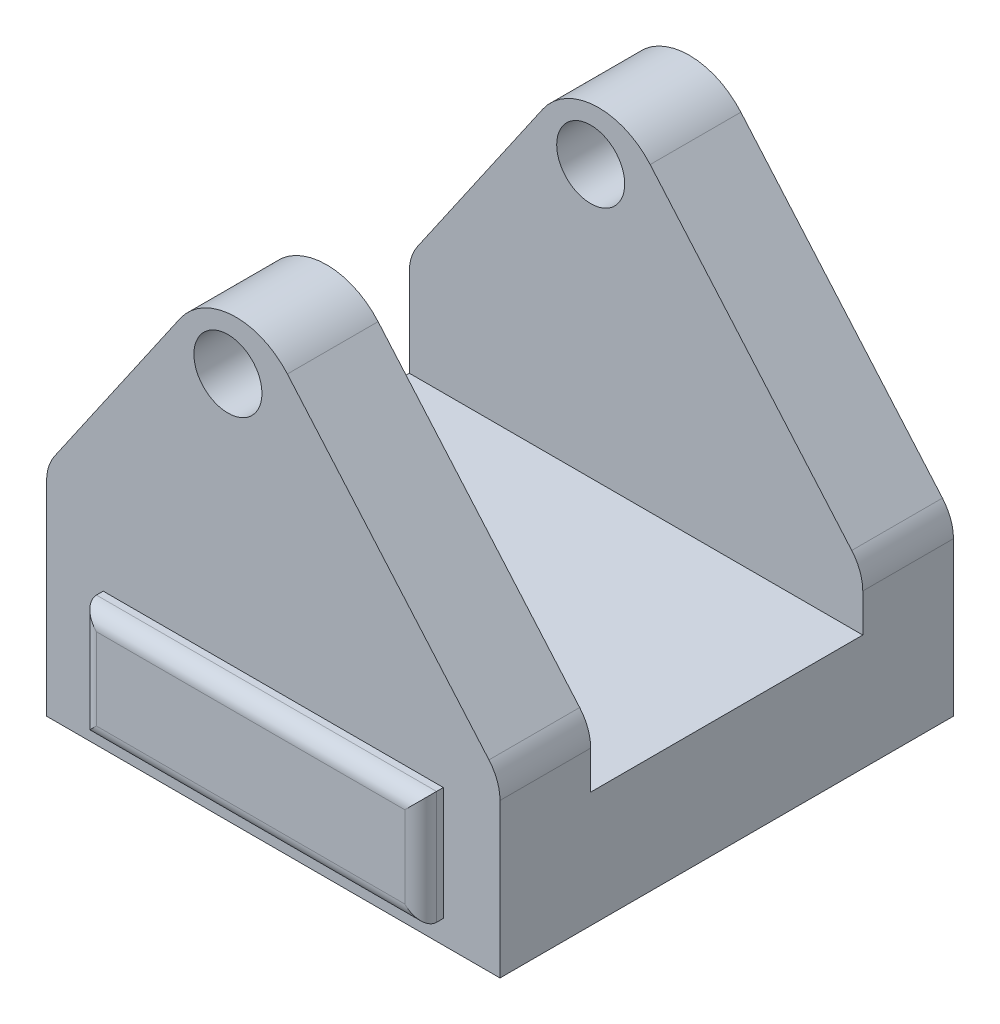
ISO-10303-21;
HEADER;
FILE_DESCRIPTION(('STEP AP214'),'2;1');
FILE_NAME('part.step','',(''),(''),'','','');
FILE_SCHEMA(('AUTOMOTIVE_DESIGN { 1 0 10303 214 1 1 1 1 }'));
ENDSEC;
DATA;
#1=APPLICATION_CONTEXT('core data for automotive mechanical design processes');
#2=APPLICATION_PROTOCOL_DEFINITION('international standard','automotive_design',2000,#1);
#3=PRODUCT_CONTEXT('',#1,'mechanical');
#4=PRODUCT('Part','Part','',(#3));
#5=PRODUCT_RELATED_PRODUCT_CATEGORY('part','',(#4));
#6=PRODUCT_DEFINITION_FORMATION('','',#4);
#7=PRODUCT_DEFINITION_CONTEXT('part definition',#1,'design');
#8=PRODUCT_DEFINITION('design','',#6,#7);
#9=PRODUCT_DEFINITION_SHAPE('','',#8);
#10=(LENGTH_UNIT() NAMED_UNIT(*) SI_UNIT(.MILLI.,.METRE.));
#11=(NAMED_UNIT(*) PLANE_ANGLE_UNIT() SI_UNIT($,.RADIAN.));
#12=(NAMED_UNIT(*) SI_UNIT($,.STERADIAN.) SOLID_ANGLE_UNIT());
#13=UNCERTAINTY_MEASURE_WITH_UNIT(LENGTH_MEASURE(1.E-05),#10,'distance_accuracy_value','');
#14=(GEOMETRIC_REPRESENTATION_CONTEXT(3) GLOBAL_UNCERTAINTY_ASSIGNED_CONTEXT((#13)) GLOBAL_UNIT_ASSIGNED_CONTEXT((#10,
#11,#12)) REPRESENTATION_CONTEXT('',''));
#15=CARTESIAN_POINT('',(0.,0.,0.));
#16=DIRECTION('',(0.,0.,1.));
#17=DIRECTION('',(1.,0.,0.));
#18=AXIS2_PLACEMENT_3D('',#15,#16,#17);
#19=CARTESIAN_POINT('',(-100.,300.,-100.));
#20=DIRECTION('',(0.,0.,1.));
#21=DIRECTION('',(1.,0.,0.));
#22=AXIS2_PLACEMENT_3D('',#19,#20,#21);
#23=PLANE('',#22);
#24=DIRECTION('',(0.65364245259833,-0.756803504326744,0.));
#25=VECTOR('',#24,1.);
#26=CARTESIAN_POINT('',(-19.1359934013816,213.188644877479,-100.));
#27=LINE('',#26,#25);
#28=CARTESIAN_POINT('',(6.22659965479949,183.823203224432,-100.));
#29=VERTEX_POINT('',#28);
#30=CARTESIAN_POINT('',(95.1360700865349,80.8816049192792,-100.));
#31=VERTEX_POINT('',#30);
#32=EDGE_CURVE('E369',#29,#31,#27,.T.);
#33=ORIENTED_EDGE('',*,*,#32,.T.);
#34=CARTESIAN_POINT('',(80.,67.8087558673126,-100.));
#35=DIRECTION('',(0.,0.,1.));
#36=DIRECTION('',(1.,0.,0.));
#37=AXIS2_PLACEMENT_3D('',#34,#35,#36);
#38=CIRCLE('',#37,20.);
#39=CARTESIAN_POINT('',(100.,67.8087558673126,-100.));
#40=VERTEX_POINT('',#39);
#41=EDGE_CURVE('E451',#31,#40,#38,.F.);
#42=ORIENTED_EDGE('',*,*,#41,.T.);
#43=DIRECTION('',(0.,-1.,0.));
#44=VECTOR('',#43,1.);
#45=CARTESIAN_POINT('',(100.,300.,-100.));
#46=LINE('',#45,#44);
#47=CARTESIAN_POINT('',(100.,0.,-100.));
#48=VERTEX_POINT('',#47);
#49=EDGE_CURVE('E412',#40,#48,#46,.T.);
#50=ORIENTED_EDGE('',*,*,#49,.T.);
#51=DIRECTION('',(-1.,0.,0.));
#52=VECTOR('',#51,1.);
#53=CARTESIAN_POINT('',(-100.,0.,-100.));
#54=LINE('',#53,#52);
#55=CARTESIAN_POINT('',(-100.,0.,-100.));
#56=VERTEX_POINT('',#55);
#57=EDGE_CURVE('E391',#48,#56,#54,.T.);
#58=ORIENTED_EDGE('',*,*,#57,.T.);
#59=DIRECTION('',(0.,-1.,0.));
#60=VECTOR('',#59,1.);
#61=CARTESIAN_POINT('',(-100.,300.,-100.));
#62=LINE('',#61,#60);
#63=CARTESIAN_POINT('',(-100.,89.7508937768441,-100.));
#64=VERTEX_POINT('',#63);
#65=EDGE_CURVE('E409',#64,#56,#62,.T.);
#66=ORIENTED_EDGE('',*,*,#65,.F.);
#67=CARTESIAN_POINT('',(-80.,89.7508937768441,-100.));
#68=DIRECTION('',(0.,0.,1.));
#69=DIRECTION('',(1.,0.,0.));
#70=AXIS2_PLACEMENT_3D('',#67,#68,#69);
#71=CIRCLE('',#70,20.);
#72=CARTESIAN_POINT('',(-96.4622250535299,101.108496793631,-100.));
#73=VERTEX_POINT('',#72);
#74=EDGE_CURVE('E448',#64,#73,#71,.F.);
#75=ORIENTED_EDGE('',*,*,#74,.T.);
#76=DIRECTION('',(0.567880150839354,0.823111252676497,0.));
#77=VECTOR('',#76,1.);
#78=CARTESIAN_POINT('',(-100.,95.9806852940173,-100.));
#79=LINE('',#78,#77);
#80=CARTESIAN_POINT('',(-41.1708430552978,181.250334171663,-100.));
#81=VERTEX_POINT('',#80);
#82=EDGE_CURVE('E365',#73,#81,#79,.T.);
#83=ORIENTED_EDGE('',*,*,#82,.T.);
#84=CARTESIAN_POINT('',(-16.4775054750028,164.213929646482,-100.));
#85=DIRECTION('',(0.,0.,1.));
#86=DIRECTION('',(1.,0.,0.));
#87=AXIS2_PLACEMENT_3D('',#84,#85,#86);
#88=CIRCLE('',#87,30.);
#89=EDGE_CURVE('E429',#81,#29,#88,.F.);
#90=ORIENTED_EDGE('',*,*,#89,.T.);
#91=EDGE_LOOP('',(#33,#42,#50,#58,#66,#75,#83,#90));
#92=FACE_BOUND('',#91,.T.);
#93=CARTESIAN_POINT('',(-20.,170.784862367412,-100.));
#94=DIRECTION('',(0.,0.,1.));
#95=DIRECTION('',(1.,0.,0.));
#96=AXIS2_PLACEMENT_3D('',#93,#94,#95);
#97=CIRCLE('',#96,15.);
#98=CARTESIAN_POINT('',(-4.99999999999998,170.784862367412,-100.));
#99=VERTEX_POINT('',#98);
#100=EDGE_CURVE('E303',#99,#99,#97,.F.);
#101=ORIENTED_EDGE('',*,*,#100,.F.);
#102=EDGE_LOOP('',(#101));
#103=FACE_BOUND('',#102,.T.);
#104=DIRECTION('',(0.,-1.,0.));
#105=VECTOR('',#104,1.);
#106=CARTESIAN_POINT('',(75.,60.002047412973,-100.));
#107=LINE('',#106,#105);
#108=CARTESIAN_POINT('',(75.,60.002047412973,-100.));
#109=VERTEX_POINT('',#108);
#110=CARTESIAN_POINT('',(75.,10.002047412973,-100.));
#111=VERTEX_POINT('',#110);
#112=EDGE_CURVE('E229',#109,#111,#107,.T.);
#113=ORIENTED_EDGE('',*,*,#112,.F.);
#114=DIRECTION('',(1.,0.,0.));
#115=VECTOR('',#114,1.);
#116=CARTESIAN_POINT('',(75.,60.002047412973,-100.));
#117=LINE('',#116,#115);
#118=CARTESIAN_POINT('',(-75.,60.002047412973,-100.));
#119=VERTEX_POINT('',#118);
#120=EDGE_CURVE('E237',#119,#109,#117,.T.);
#121=ORIENTED_EDGE('',*,*,#120,.F.);
#122=DIRECTION('',(0.,1.,0.));
#123=VECTOR('',#122,1.);
#124=CARTESIAN_POINT('',(-75.,60.002047412973,-100.));
#125=LINE('',#124,#123);
#126=CARTESIAN_POINT('',(-75.,10.0020474129729,-100.));
#127=VERTEX_POINT('',#126);
#128=EDGE_CURVE('E250',#127,#119,#125,.T.);
#129=ORIENTED_EDGE('',*,*,#128,.F.);
#130=DIRECTION('',(-1.,0.,0.));
#131=VECTOR('',#130,1.);
#132=CARTESIAN_POINT('',(75.,10.002047412973,-100.));
#133=LINE('',#132,#131);
#134=EDGE_CURVE('E245',#111,#127,#133,.T.);
#135=ORIENTED_EDGE('',*,*,#134,.F.);
#136=EDGE_LOOP('',(#113,#121,#129,#135));
#137=FACE_BOUND('',#136,.T.);
#138=ADVANCED_FACE('F39',(#92,#103,#137),#23,.F.);
#139=CARTESIAN_POINT('',(-100.,300.,100.));
#140=DIRECTION('',(0.,0.,-1.));
#141=DIRECTION('',(-1.,0.,0.));
#142=AXIS2_PLACEMENT_3D('',#139,#140,#141);
#143=PLANE('',#142);
#144=DIRECTION('',(0.,-1.,0.));
#145=VECTOR('',#144,1.);
#146=CARTESIAN_POINT('',(100.,300.,100.));
#147=LINE('',#146,#145);
#148=CARTESIAN_POINT('',(100.,67.8087558673126,100.));
#149=VERTEX_POINT('',#148);
#150=CARTESIAN_POINT('',(100.,0.,100.));
#151=VERTEX_POINT('',#150);
#152=EDGE_CURVE('E403',#149,#151,#147,.T.);
#153=ORIENTED_EDGE('',*,*,#152,.F.);
#154=CARTESIAN_POINT('',(80.,67.8087558673126,100.));
#155=DIRECTION('',(0.,0.,-1.));
#156=DIRECTION('',(-1.,0.,0.));
#157=AXIS2_PLACEMENT_3D('',#154,#155,#156);
#158=CIRCLE('',#157,20.);
#159=CARTESIAN_POINT('',(95.1360700865349,80.8816049192792,100.));
#160=VERTEX_POINT('',#159);
#161=EDGE_CURVE('E440',#149,#160,#158,.F.);
#162=ORIENTED_EDGE('',*,*,#161,.T.);
#163=DIRECTION('',(0.65364245259833,-0.756803504326744,0.));
#164=VECTOR('',#163,1.);
#165=CARTESIAN_POINT('',(-19.1359934013816,213.188644877479,100.));
#166=LINE('',#165,#164);
#167=CARTESIAN_POINT('',(6.22659965479949,183.823203224432,100.));
#168=VERTEX_POINT('',#167);
#169=EDGE_CURVE('E370',#168,#160,#166,.T.);
#170=ORIENTED_EDGE('',*,*,#169,.F.);
#171=CARTESIAN_POINT('',(-16.4775054750028,164.213929646482,100.));
#172=DIRECTION('',(0.,0.,-1.));
#173=DIRECTION('',(-1.,0.,0.));
#174=AXIS2_PLACEMENT_3D('',#171,#172,#173);
#175=CIRCLE('',#174,30.);
#176=CARTESIAN_POINT('',(-41.1708430552978,181.250334171663,100.));
#177=VERTEX_POINT('',#176);
#178=EDGE_CURVE('E420',#168,#177,#175,.F.);
#179=ORIENTED_EDGE('',*,*,#178,.T.);
#180=DIRECTION('',(0.567880150839354,0.823111252676497,0.));
#181=VECTOR('',#180,1.);
#182=CARTESIAN_POINT('',(-100.,95.9806852940173,100.));
#183=LINE('',#182,#181);
#184=CARTESIAN_POINT('',(-96.4622250535299,101.108496793631,100.));
#185=VERTEX_POINT('',#184);
#186=EDGE_CURVE('E364',#185,#177,#183,.T.);
#187=ORIENTED_EDGE('',*,*,#186,.F.);
#188=CARTESIAN_POINT('',(-80.,89.7508937768441,100.));
#189=DIRECTION('',(0.,0.,-1.));
#190=DIRECTION('',(-1.,0.,0.));
#191=AXIS2_PLACEMENT_3D('',#188,#189,#190);
#192=CIRCLE('',#191,20.);
#193=CARTESIAN_POINT('',(-100.,89.7508937768441,100.));
#194=VERTEX_POINT('',#193);
#195=EDGE_CURVE('E437',#185,#194,#192,.F.);
#196=ORIENTED_EDGE('',*,*,#195,.T.);
#197=DIRECTION('',(0.,-1.,0.));
#198=VECTOR('',#197,1.);
#199=CARTESIAN_POINT('',(-100.,300.,100.));
#200=LINE('',#199,#198);
#201=CARTESIAN_POINT('',(-100.,0.,100.));
#202=VERTEX_POINT('',#201);
#203=EDGE_CURVE('E406',#194,#202,#200,.T.);
#204=ORIENTED_EDGE('',*,*,#203,.T.);
#205=DIRECTION('',(1.,0.,0.));
#206=VECTOR('',#205,1.);
#207=CARTESIAN_POINT('',(-100.,0.,100.));
#208=LINE('',#207,#206);
#209=EDGE_CURVE('E399',#202,#151,#208,.T.);
#210=ORIENTED_EDGE('',*,*,#209,.T.);
#211=EDGE_LOOP('',(#153,#162,#170,#179,#187,#196,#204,#210));
#212=FACE_BOUND('',#211,.T.);
#213=CARTESIAN_POINT('',(-20.,170.784862367412,100.));
#214=DIRECTION('',(0.,0.,-1.));
#215=DIRECTION('',(-1.,0.,0.));
#216=AXIS2_PLACEMENT_3D('',#213,#214,#215);
#217=CIRCLE('',#216,15.);
#218=CARTESIAN_POINT('',(-35.,170.784862367412,100.));
#219=VERTEX_POINT('',#218);
#220=EDGE_CURVE('E299',#219,#219,#217,.F.);
#221=ORIENTED_EDGE('',*,*,#220,.F.);
#222=EDGE_LOOP('',(#221));
#223=FACE_BOUND('',#222,.T.);
#224=DIRECTION('',(0.,-1.,0.));
#225=VECTOR('',#224,1.);
#226=CARTESIAN_POINT('',(-75.,60.2601360571516,100.));
#227=LINE('',#226,#225);
#228=CARTESIAN_POINT('',(-75.,60.2601360571516,100.));
#229=VERTEX_POINT('',#228);
#230=CARTESIAN_POINT('',(-75.,10.2601360571516,100.));
#231=VERTEX_POINT('',#230);
#232=EDGE_CURVE('E265',#229,#231,#227,.T.);
#233=ORIENTED_EDGE('',*,*,#232,.F.);
#234=DIRECTION('',(-1.,0.,0.));
#235=VECTOR('',#234,1.);
#236=CARTESIAN_POINT('',(-75.,60.2601360571516,100.));
#237=LINE('',#236,#235);
#238=CARTESIAN_POINT('',(75.,60.2601360571516,100.));
#239=VERTEX_POINT('',#238);
#240=EDGE_CURVE('E278',#239,#229,#237,.T.);
#241=ORIENTED_EDGE('',*,*,#240,.F.);
#242=DIRECTION('',(0.,1.,0.));
#243=VECTOR('',#242,1.);
#244=CARTESIAN_POINT('',(75.,60.2601360571516,100.));
#245=LINE('',#244,#243);
#246=CARTESIAN_POINT('',(75.,10.2601360571515,100.));
#247=VERTEX_POINT('',#246);
#248=EDGE_CURVE('E274',#247,#239,#245,.T.);
#249=ORIENTED_EDGE('',*,*,#248,.F.);
#250=DIRECTION('',(1.,0.,0.));
#251=VECTOR('',#250,1.);
#252=CARTESIAN_POINT('',(-75.,10.2601360571516,100.));
#253=LINE('',#252,#251);
#254=EDGE_CURVE('E269',#231,#247,#253,.T.);
#255=ORIENTED_EDGE('',*,*,#254,.F.);
#256=EDGE_LOOP('',(#233,#241,#249,#255));
#257=FACE_BOUND('',#256,.T.);
#258=ADVANCED_FACE('F569',(#212,#223,#257),#143,.F.);
#259=CARTESIAN_POINT('',(-19.1359934013816,213.188644877479,-100.));
#260=DIRECTION('',(-0.756803504326744,-0.65364245259833,0.));
#261=DIRECTION('',(0.65364245259833,-0.756803504326744,0.));
#262=AXIS2_PLACEMENT_3D('',#259,#260,#261);
#263=PLANE('',#262);
#264=DIRECTION('',(0.,0.,1.));
#265=VECTOR('',#264,1.);
#266=CARTESIAN_POINT('',(95.1360700865349,80.8816049192792,-100.));
#267=LINE('',#266,#265);
#268=CARTESIAN_POINT('',(95.1360700865349,80.8816049192792,60.));
#269=VERTEX_POINT('',#268);
#270=EDGE_CURVE('E444',#160,#269,#267,.F.);
#271=ORIENTED_EDGE('',*,*,#270,.T.);
#272=DIRECTION('',(-0.65364245259833,0.756803504326744,0.));
#273=VECTOR('',#272,1.);
#274=CARTESIAN_POINT('',(-19.1359934013816,213.188644877479,60.));
#275=LINE('',#274,#273);
#276=CARTESIAN_POINT('',(6.22659965479947,183.823203224432,60.));
#277=VERTEX_POINT('',#276);
#278=EDGE_CURVE('E357',#269,#277,#275,.T.);
#279=ORIENTED_EDGE('',*,*,#278,.T.);
#280=DIRECTION('',(0.,0.,1.));
#281=VECTOR('',#280,1.);
#282=CARTESIAN_POINT('',(6.22659965479949,183.823203224432,-100.));
#283=LINE('',#282,#281);
#284=EDGE_CURVE('E415',#277,#168,#283,.T.);
#285=ORIENTED_EDGE('',*,*,#284,.T.);
#286=ORIENTED_EDGE('',*,*,#169,.T.);
#287=EDGE_LOOP('',(#271,#279,#285,#286));
#288=FACE_BOUND('',#287,.T.);
#289=ADVANCED_FACE('F575',(#288),#263,.F.);
#290=CARTESIAN_POINT('',(-100.,95.9806852940173,-100.));
#291=DIRECTION('',(0.823111252676497,-0.567880150839354,0.));
#292=DIRECTION('',(0.567880150839354,0.823111252676498,0.));
#293=AXIS2_PLACEMENT_3D('',#290,#291,#292);
#294=PLANE('',#293);
#295=DIRECTION('',(0.,0.,1.));
#296=VECTOR('',#295,1.);
#297=CARTESIAN_POINT('',(-41.1708430552978,181.250334171663,-100.));
#298=LINE('',#297,#296);
#299=CARTESIAN_POINT('',(-41.1708430552978,181.250334171663,60.));
#300=VERTEX_POINT('',#299);
#301=EDGE_CURVE('E425',#177,#300,#298,.F.);
#302=ORIENTED_EDGE('',*,*,#301,.T.);
#303=DIRECTION('',(-0.567880150839354,-0.823111252676498,0.));
#304=VECTOR('',#303,1.);
#305=CARTESIAN_POINT('',(-100.,95.9806852940173,60.));
#306=LINE('',#305,#304);
#307=CARTESIAN_POINT('',(-96.4622250535299,101.108496793631,60.));
#308=VERTEX_POINT('',#307);
#309=EDGE_CURVE('E350',#300,#308,#306,.T.);
#310=ORIENTED_EDGE('',*,*,#309,.T.);
#311=DIRECTION('',(0.,0.,1.));
#312=VECTOR('',#311,1.);
#313=CARTESIAN_POINT('',(-96.4622250535299,101.108496793631,-100.));
#314=LINE('',#313,#312);
#315=EDGE_CURVE('E454',#308,#185,#314,.T.);
#316=ORIENTED_EDGE('',*,*,#315,.T.);
#317=ORIENTED_EDGE('',*,*,#186,.T.);
#318=EDGE_LOOP('',(#302,#310,#316,#317));
#319=FACE_BOUND('',#318,.T.);
#320=ADVANCED_FACE('F816',(#319),#294,.F.);
#321=CARTESIAN_POINT('',(-16.4775054750028,164.213929646482,-100.));
#322=DIRECTION('',(0.,0.,1.));
#323=DIRECTION('',(1.,0.,0.));
#324=AXIS2_PLACEMENT_3D('',#321,#322,#323);
#325=CYLINDRICAL_SURFACE('',#324,30.);
#326=CARTESIAN_POINT('',(-16.4775054750028,164.213929646482,60.));
#327=DIRECTION('',(0.,0.,1.));
#328=DIRECTION('',(1.,0.,0.));
#329=AXIS2_PLACEMENT_3D('',#326,#327,#328);
#330=CIRCLE('',#329,30.);
#331=EDGE_CURVE('E354',#300,#277,#330,.F.);
#332=ORIENTED_EDGE('',*,*,#331,.F.);
#333=ORIENTED_EDGE('',*,*,#301,.F.);
#334=ORIENTED_EDGE('',*,*,#178,.F.);
#335=ORIENTED_EDGE('',*,*,#284,.F.);
#336=EDGE_LOOP('',(#332,#333,#334,#335));
#337=FACE_BOUND('',#336,.T.);
#338=ADVANCED_FACE('F593',(#337),#325,.T.);
#339=CARTESIAN_POINT('',(80.,67.8087558673126,100.));
#340=DIRECTION('',(0.,0.,1.));
#341=DIRECTION('',(1.,0.,0.));
#342=AXIS2_PLACEMENT_3D('',#339,#340,#341);
#343=CYLINDRICAL_SURFACE('',#342,20.);
#344=CARTESIAN_POINT('',(80.,67.8087558673126,60.));
#345=DIRECTION('',(0.,0.,1.));
#346=DIRECTION('',(1.,0.,0.));
#347=AXIS2_PLACEMENT_3D('',#344,#345,#346);
#348=CIRCLE('',#347,20.);
#349=CARTESIAN_POINT('',(100.,67.8087558673126,60.));
#350=VERTEX_POINT('',#349);
#351=EDGE_CURVE('E361',#269,#350,#348,.F.);
#352=ORIENTED_EDGE('',*,*,#351,.F.);
#353=ORIENTED_EDGE('',*,*,#270,.F.);
#354=ORIENTED_EDGE('',*,*,#161,.F.);
#355=DIRECTION('',(0.,0.,1.));
#356=VECTOR('',#355,1.);
#357=CARTESIAN_POINT('',(100.,67.8087558673126,100.));
#358=LINE('',#357,#356);
#359=EDGE_CURVE('E432',#350,#149,#358,.T.);
#360=ORIENTED_EDGE('',*,*,#359,.F.);
#361=EDGE_LOOP('',(#352,#353,#354,#360));
#362=FACE_BOUND('',#361,.T.);
#363=ADVANCED_FACE('F598',(#362),#343,.T.);
#364=CARTESIAN_POINT('',(-80.,89.7508937768441,-100.));
#365=DIRECTION('',(0.,0.,1.));
#366=DIRECTION('',(1.,0.,0.));
#367=AXIS2_PLACEMENT_3D('',#364,#365,#366);
#368=CYLINDRICAL_SURFACE('',#367,20.);
#369=CARTESIAN_POINT('',(-80.,89.7508937768441,60.));
#370=DIRECTION('',(0.,0.,1.));
#371=DIRECTION('',(1.,0.,0.));
#372=AXIS2_PLACEMENT_3D('',#369,#370,#371);
#373=CIRCLE('',#372,20.);
#374=CARTESIAN_POINT('',(-100.,89.7508937768441,60.));
#375=VERTEX_POINT('',#374);
#376=EDGE_CURVE('E467',#375,#308,#373,.F.);
#377=ORIENTED_EDGE('',*,*,#376,.F.);
#378=DIRECTION('',(0.,0.,1.));
#379=VECTOR('',#378,1.);
#380=CARTESIAN_POINT('',(-100.,89.7508937768441,100.));
#381=LINE('',#380,#379);
#382=EDGE_CURVE('E460',#194,#375,#381,.F.);
#383=ORIENTED_EDGE('',*,*,#382,.F.);
#384=ORIENTED_EDGE('',*,*,#195,.F.);
#385=ORIENTED_EDGE('',*,*,#315,.F.);
#386=EDGE_LOOP('',(#377,#383,#384,#385));
#387=FACE_BOUND('',#386,.T.);
#388=ADVANCED_FACE('F585',(#387),#368,.T.);
#389=CARTESIAN_POINT('',(100.,300.,100.));
#390=DIRECTION('',(-1.,0.,0.));
#391=DIRECTION('',(0.,0.,1.));
#392=AXIS2_PLACEMENT_3D('',#389,#390,#391);
#393=PLANE('',#392);
#394=DIRECTION('',(0.,0.,-1.));
#395=VECTOR('',#394,1.);
#396=CARTESIAN_POINT('',(100.,51.,-60.));
#397=LINE('',#396,#395);
#398=CARTESIAN_POINT('',(100.,51.,60.));
#399=VERTEX_POINT('',#398);
#400=CARTESIAN_POINT('',(100.,51.,-60.));
#401=VERTEX_POINT('',#400);
#402=EDGE_CURVE('E307',#399,#401,#397,.T.);
#403=ORIENTED_EDGE('',*,*,#402,.F.);
#404=DIRECTION('',(0.,1.,0.));
#405=VECTOR('',#404,1.);
#406=CARTESIAN_POINT('',(100.,51.,60.));
#407=LINE('',#406,#405);
#408=EDGE_CURVE('E323',#399,#350,#407,.T.);
#409=ORIENTED_EDGE('',*,*,#408,.T.);
#410=ORIENTED_EDGE('',*,*,#359,.T.);
#411=ORIENTED_EDGE('',*,*,#152,.T.);
#412=DIRECTION('',(0.,0.,-1.));
#413=VECTOR('',#412,1.);
#414=CARTESIAN_POINT('',(100.,0.,100.));
#415=LINE('',#414,#413);
#416=EDGE_CURVE('E384',#151,#48,#415,.T.);
#417=ORIENTED_EDGE('',*,*,#416,.T.);
#418=ORIENTED_EDGE('',*,*,#49,.F.);
#419=CARTESIAN_POINT('',(100.,67.8087558673126,-60.));
#420=VERTEX_POINT('',#419);
#421=EDGE_CURVE('E433',#40,#420,#358,.T.);
#422=ORIENTED_EDGE('',*,*,#421,.T.);
#423=DIRECTION('',(0.,1.,0.));
#424=VECTOR('',#423,1.);
#425=CARTESIAN_POINT('',(100.,51.,-60.));
#426=LINE('',#425,#424);
#427=EDGE_CURVE('E322',#401,#420,#426,.T.);
#428=ORIENTED_EDGE('',*,*,#427,.F.);
#429=EDGE_LOOP('',(#403,#409,#410,#411,#417,#418,#422,#428));
#430=FACE_BOUND('',#429,.T.);
#431=ADVANCED_FACE('F582',(#430),#393,.F.);
#432=CARTESIAN_POINT('',(-100.,300.,100.));
#433=DIRECTION('',(1.,0.,0.));
#434=DIRECTION('',(0.,0.,-1.));
#435=AXIS2_PLACEMENT_3D('',#432,#433,#434);
#436=PLANE('',#435);
#437=ORIENTED_EDGE('',*,*,#382,.T.);
#438=DIRECTION('',(0.,1.,0.));
#439=VECTOR('',#438,1.);
#440=CARTESIAN_POINT('',(-100.,51.,60.));
#441=LINE('',#440,#439);
#442=CARTESIAN_POINT('',(-100.,51.,60.));
#443=VERTEX_POINT('',#442);
#444=EDGE_CURVE('E328',#443,#375,#441,.T.);
#445=ORIENTED_EDGE('',*,*,#444,.F.);
#446=DIRECTION('',(0.,0.,1.));
#447=VECTOR('',#446,1.);
#448=CARTESIAN_POINT('',(-100.,51.,-60.));
#449=LINE('',#448,#447);
#450=CARTESIAN_POINT('',(-100.,51.,-60.));
#451=VERTEX_POINT('',#450);
#452=EDGE_CURVE('E315',#451,#443,#449,.T.);
#453=ORIENTED_EDGE('',*,*,#452,.F.);
#454=DIRECTION('',(0.,1.,0.));
#455=VECTOR('',#454,1.);
#456=CARTESIAN_POINT('',(-100.,51.,-60.));
#457=LINE('',#456,#455);
#458=CARTESIAN_POINT('',(-100.,89.7508937768441,-60.));
#459=VERTEX_POINT('',#458);
#460=EDGE_CURVE('E331',#451,#459,#457,.T.);
#461=ORIENTED_EDGE('',*,*,#460,.T.);
#462=EDGE_CURVE('E459',#459,#64,#381,.F.);
#463=ORIENTED_EDGE('',*,*,#462,.T.);
#464=ORIENTED_EDGE('',*,*,#65,.T.);
#465=DIRECTION('',(0.,0.,1.));
#466=VECTOR('',#465,1.);
#467=CARTESIAN_POINT('',(-100.,0.,100.));
#468=LINE('',#467,#466);
#469=EDGE_CURVE('E395',#56,#202,#468,.T.);
#470=ORIENTED_EDGE('',*,*,#469,.T.);
#471=ORIENTED_EDGE('',*,*,#203,.F.);
#472=EDGE_LOOP('',(#437,#445,#453,#461,#463,#464,#470,#471));
#473=FACE_BOUND('',#472,.T.);
#474=ADVANCED_FACE('F581',(#473),#436,.F.);
#475=CARTESIAN_POINT('',(0.,0.,0.));
#476=DIRECTION('',(0.,-1.,0.));
#477=DIRECTION('',(0.,0.,-1.));
#478=AXIS2_PLACEMENT_3D('',#475,#476,#477);
#479=PLANE('',#478);
#480=CARTESIAN_POINT('',(0.,0.,0.));
#481=DIRECTION('',(0.,-1.,0.));
#482=DIRECTION('',(0.,0.,-1.));
#483=AXIS2_PLACEMENT_3D('',#480,#481,#482);
#484=CIRCLE('',#483,75.);
#485=CARTESIAN_POINT('',(0.,0.,-75.));
#486=VERTEX_POINT('',#485);
#487=EDGE_CURVE('E374',#486,#486,#484,.T.);
#488=ORIENTED_EDGE('',*,*,#487,.F.);
#489=EDGE_LOOP('',(#488));
#490=FACE_BOUND('',#489,.T.);
#491=ORIENTED_EDGE('',*,*,#416,.F.);
#492=ORIENTED_EDGE('',*,*,#209,.F.);
#493=ORIENTED_EDGE('',*,*,#469,.F.);
#494=ORIENTED_EDGE('',*,*,#57,.F.);
#495=EDGE_LOOP('',(#491,#492,#493,#494));
#496=FACE_BOUND('',#495,.T.);
#497=ADVANCED_FACE('F836',(#490,#496),#479,.T.);
#498=CARTESIAN_POINT('',(0.,50.,0.));
#499=DIRECTION('',(0.,-1.,0.));
#500=DIRECTION('',(0.,0.,-1.));
#501=AXIS2_PLACEMENT_3D('',#498,#499,#500);
#502=CYLINDRICAL_SURFACE('',#501,75.);
#503=CARTESIAN_POINT('',(0.,50.,0.));
#504=DIRECTION('',(0.,-1.,0.));
#505=DIRECTION('',(0.,0.,-1.));
#506=AXIS2_PLACEMENT_3D('',#503,#504,#505);
#507=CIRCLE('',#506,75.);
#508=CARTESIAN_POINT('',(0.,50.,-75.));
#509=VERTEX_POINT('',#508);
#510=EDGE_CURVE('E380',#509,#509,#507,.T.);
#511=ORIENTED_EDGE('',*,*,#510,.F.);
#512=EDGE_LOOP('',(#511));
#513=FACE_BOUND('',#512,.T.);
#514=ORIENTED_EDGE('',*,*,#487,.T.);
#515=EDGE_LOOP('',(#514));
#516=FACE_BOUND('',#515,.T.);
#517=ADVANCED_FACE('F888',(#513,#516),#502,.F.);
#518=CARTESIAN_POINT('',(0.,50.,0.));
#519=DIRECTION('',(0.,-1.,0.));
#520=DIRECTION('',(0.,0.,-1.));
#521=AXIS2_PLACEMENT_3D('',#518,#519,#520);
#522=PLANE('',#521);
#523=ORIENTED_EDGE('',*,*,#510,.T.);
#524=EDGE_LOOP('',(#523));
#525=FACE_BOUND('',#524,.T.);
#526=ADVANCED_FACE('F824',(#525),#522,.T.);
#527=CARTESIAN_POINT('',(6.22659965479947,183.823203224432,-60.));
#528=VERTEX_POINT('',#527);
#529=EDGE_CURVE('E416',#29,#528,#283,.T.);
#530=ORIENTED_EDGE('',*,*,#529,.T.);
#531=DIRECTION('',(0.65364245259833,-0.756803504326744,0.));
#532=VECTOR('',#531,1.);
#533=CARTESIAN_POINT('',(-19.1359934013816,213.188644877479,-60.));
#534=LINE('',#533,#532);
#535=CARTESIAN_POINT('',(95.1360700865349,80.8816049192792,-60.));
#536=VERTEX_POINT('',#535);
#537=EDGE_CURVE('E343',#528,#536,#534,.T.);
#538=ORIENTED_EDGE('',*,*,#537,.T.);
#539=EDGE_CURVE('E443',#536,#31,#267,.F.);
#540=ORIENTED_EDGE('',*,*,#539,.T.);
#541=ORIENTED_EDGE('',*,*,#32,.F.);
#542=EDGE_LOOP('',(#530,#538,#540,#541));
#543=FACE_BOUND('',#542,.T.);
#544=ADVANCED_FACE('F813',(#543),#263,.F.);
#545=CARTESIAN_POINT('',(-96.4622250535299,101.108496793631,-60.));
#546=VERTEX_POINT('',#545);
#547=EDGE_CURVE('E455',#73,#546,#314,.T.);
#548=ORIENTED_EDGE('',*,*,#547,.T.);
#549=DIRECTION('',(0.567880150839354,0.823111252676498,0.));
#550=VECTOR('',#549,1.);
#551=CARTESIAN_POINT('',(-100.,95.9806852940173,-60.));
#552=LINE('',#551,#550);
#553=CARTESIAN_POINT('',(-41.1708430552978,181.250334171663,-60.));
#554=VERTEX_POINT('',#553);
#555=EDGE_CURVE('E327',#546,#554,#552,.T.);
#556=ORIENTED_EDGE('',*,*,#555,.T.);
#557=EDGE_CURVE('E424',#554,#81,#298,.F.);
#558=ORIENTED_EDGE('',*,*,#557,.T.);
#559=ORIENTED_EDGE('',*,*,#82,.F.);
#560=EDGE_LOOP('',(#548,#556,#558,#559));
#561=FACE_BOUND('',#560,.T.);
#562=ADVANCED_FACE('F591',(#561),#294,.F.);
#563=CARTESIAN_POINT('',(-16.4775054750028,164.213929646482,-60.));
#564=DIRECTION('',(0.,0.,-1.));
#565=DIRECTION('',(-1.,0.,0.));
#566=AXIS2_PLACEMENT_3D('',#563,#564,#565);
#567=CIRCLE('',#566,30.);
#568=EDGE_CURVE('E340',#528,#554,#567,.F.);
#569=ORIENTED_EDGE('',*,*,#568,.F.);
#570=ORIENTED_EDGE('',*,*,#529,.F.);
#571=ORIENTED_EDGE('',*,*,#89,.F.);
#572=ORIENTED_EDGE('',*,*,#557,.F.);
#573=EDGE_LOOP('',(#569,#570,#571,#572));
#574=FACE_BOUND('',#573,.T.);
#575=ADVANCED_FACE('F587',(#574),#325,.T.);
#576=CARTESIAN_POINT('',(80.,67.8087558673126,-60.));
#577=DIRECTION('',(0.,0.,-1.));
#578=DIRECTION('',(-1.,0.,0.));
#579=AXIS2_PLACEMENT_3D('',#576,#577,#578);
#580=CIRCLE('',#579,20.);
#581=EDGE_CURVE('E347',#420,#536,#580,.F.);
#582=ORIENTED_EDGE('',*,*,#581,.F.);
#583=ORIENTED_EDGE('',*,*,#421,.F.);
#584=ORIENTED_EDGE('',*,*,#41,.F.);
#585=ORIENTED_EDGE('',*,*,#539,.F.);
#586=EDGE_LOOP('',(#582,#583,#584,#585));
#587=FACE_BOUND('',#586,.T.);
#588=ADVANCED_FACE('F590',(#587),#343,.T.);
#589=CARTESIAN_POINT('',(-80.,89.7508937768441,-60.));
#590=DIRECTION('',(0.,0.,-1.));
#591=DIRECTION('',(-1.,0.,0.));
#592=AXIS2_PLACEMENT_3D('',#589,#590,#591);
#593=CIRCLE('',#592,20.);
#594=EDGE_CURVE('E464',#546,#459,#593,.F.);
#595=ORIENTED_EDGE('',*,*,#594,.F.);
#596=ORIENTED_EDGE('',*,*,#547,.F.);
#597=ORIENTED_EDGE('',*,*,#74,.F.);
#598=ORIENTED_EDGE('',*,*,#462,.F.);
#599=EDGE_LOOP('',(#595,#596,#597,#598));
#600=FACE_BOUND('',#599,.T.);
#601=ADVANCED_FACE('F596',(#600),#368,.T.);
#602=CARTESIAN_POINT('',(-100.,51.,60.));
#603=DIRECTION('',(0.,0.,1.));
#604=DIRECTION('',(1.,0.,0.));
#605=AXIS2_PLACEMENT_3D('',#602,#603,#604);
#606=PLANE('',#605);
#607=CARTESIAN_POINT('',(-20.,170.784862367412,60.));
#608=DIRECTION('',(0.,0.,1.));
#609=DIRECTION('',(1.,0.,0.));
#610=AXIS2_PLACEMENT_3D('',#607,#608,#609);
#611=CIRCLE('',#610,15.);
#612=CARTESIAN_POINT('',(-4.99999999999998,170.784862367412,60.));
#613=VERTEX_POINT('',#612);
#614=EDGE_CURVE('E295',#613,#613,#611,.F.);
#615=ORIENTED_EDGE('',*,*,#614,.F.);
#616=EDGE_LOOP('',(#615));
#617=FACE_BOUND('',#616,.T.);
#618=ORIENTED_EDGE('',*,*,#351,.T.);
#619=ORIENTED_EDGE('',*,*,#408,.F.);
#620=DIRECTION('',(1.,0.,0.));
#621=VECTOR('',#620,1.);
#622=CARTESIAN_POINT('',(-100.,51.,60.));
#623=LINE('',#622,#621);
#624=EDGE_CURVE('E318',#443,#399,#623,.T.);
#625=ORIENTED_EDGE('',*,*,#624,.F.);
#626=ORIENTED_EDGE('',*,*,#444,.T.);
#627=ORIENTED_EDGE('',*,*,#376,.T.);
#628=ORIENTED_EDGE('',*,*,#309,.F.);
#629=ORIENTED_EDGE('',*,*,#331,.T.);
#630=ORIENTED_EDGE('',*,*,#278,.F.);
#631=EDGE_LOOP('',(#618,#619,#625,#626,#627,#628,#629,#630));
#632=FACE_BOUND('',#631,.T.);
#633=ADVANCED_FACE('F601',(#617,#632),#606,.F.);
#634=CARTESIAN_POINT('',(-100.,51.,-60.));
#635=DIRECTION('',(0.,0.,-1.));
#636=DIRECTION('',(-1.,0.,0.));
#637=AXIS2_PLACEMENT_3D('',#634,#635,#636);
#638=PLANE('',#637);
#639=CARTESIAN_POINT('',(-20.,170.784862367412,-60.));
#640=DIRECTION('',(0.,0.,-1.));
#641=DIRECTION('',(-1.,0.,0.));
#642=AXIS2_PLACEMENT_3D('',#639,#640,#641);
#643=CIRCLE('',#642,15.);
#644=CARTESIAN_POINT('',(-35.,170.784862367412,-60.));
#645=VERTEX_POINT('',#644);
#646=EDGE_CURVE('E294',#645,#645,#643,.F.);
#647=ORIENTED_EDGE('',*,*,#646,.F.);
#648=EDGE_LOOP('',(#647));
#649=FACE_BOUND('',#648,.T.);
#650=ORIENTED_EDGE('',*,*,#581,.T.);
#651=ORIENTED_EDGE('',*,*,#537,.F.);
#652=ORIENTED_EDGE('',*,*,#568,.T.);
#653=ORIENTED_EDGE('',*,*,#555,.F.);
#654=ORIENTED_EDGE('',*,*,#594,.T.);
#655=ORIENTED_EDGE('',*,*,#460,.F.);
#656=DIRECTION('',(-1.,0.,0.));
#657=VECTOR('',#656,1.);
#658=CARTESIAN_POINT('',(-100.,51.,-60.));
#659=LINE('',#658,#657);
#660=EDGE_CURVE('E311',#401,#451,#659,.T.);
#661=ORIENTED_EDGE('',*,*,#660,.F.);
#662=ORIENTED_EDGE('',*,*,#427,.T.);
#663=EDGE_LOOP('',(#650,#651,#652,#653,#654,#655,#661,#662));
#664=FACE_BOUND('',#663,.T.);
#665=ADVANCED_FACE('F763',(#649,#664),#638,.F.);
#666=CARTESIAN_POINT('',(0.,51.,0.));
#667=DIRECTION('',(0.,1.,0.));
#668=DIRECTION('',(0.,0.,1.));
#669=AXIS2_PLACEMENT_3D('',#666,#667,#668);
#670=PLANE('',#669);
#671=ORIENTED_EDGE('',*,*,#402,.T.);
#672=ORIENTED_EDGE('',*,*,#660,.T.);
#673=ORIENTED_EDGE('',*,*,#452,.T.);
#674=ORIENTED_EDGE('',*,*,#624,.T.);
#675=EDGE_LOOP('',(#671,#672,#673,#674));
#676=FACE_BOUND('',#675,.T.);
#677=ADVANCED_FACE('F756',(#676),#670,.T.);
#678=CARTESIAN_POINT('',(-20.,170.784862367412,-140.));
#679=DIRECTION('',(0.,0.,1.));
#680=DIRECTION('',(1.,0.,0.));
#681=AXIS2_PLACEMENT_3D('',#678,#679,#680);
#682=CYLINDRICAL_SURFACE('',#681,15.);
#683=ORIENTED_EDGE('',*,*,#646,.T.);
#684=EDGE_LOOP('',(#683));
#685=FACE_BOUND('',#684,.T.);
#686=ORIENTED_EDGE('',*,*,#100,.T.);
#687=EDGE_LOOP('',(#686));
#688=FACE_BOUND('',#687,.T.);
#689=ADVANCED_FACE('F746',(#685,#688),#682,.F.);
#690=ORIENTED_EDGE('',*,*,#614,.T.);
#691=EDGE_LOOP('',(#690));
#692=FACE_BOUND('',#691,.T.);
#693=ORIENTED_EDGE('',*,*,#220,.T.);
#694=EDGE_LOOP('',(#693));
#695=FACE_BOUND('',#694,.T.);
#696=ADVANCED_FACE('F729',(#692,#695),#682,.F.);
#697=CARTESIAN_POINT('',(-75.,60.2601360571516,110.));
#698=DIRECTION('',(1.,0.,0.));
#699=DIRECTION('',(0.,1.,0.));
#700=AXIS2_PLACEMENT_3D('',#697,#698,#699);
#701=PLANE('',#700);
#702=DIRECTION('',(0.,0.,-1.));
#703=VECTOR('',#702,1.);
#704=CARTESIAN_POINT('',(-75.,10.2601360571516,110.));
#705=LINE('',#704,#703);
#706=CARTESIAN_POINT('',(-75.,10.2601360571516,103.));
#707=VERTEX_POINT('',#706);
#708=EDGE_CURVE('E291',#707,#231,#705,.T.);
#709=ORIENTED_EDGE('',*,*,#708,.F.);
#710=DIRECTION('',(0.,-1.,0.));
#711=VECTOR('',#710,1.);
#712=CARTESIAN_POINT('',(-75.,60.2601360571516,103.));
#713=LINE('',#712,#711);
#714=CARTESIAN_POINT('',(-75.,60.2601360571516,103.));
#715=VERTEX_POINT('',#714);
#716=EDGE_CURVE('E496',#707,#715,#713,.F.);
#717=ORIENTED_EDGE('',*,*,#716,.T.);
#718=DIRECTION('',(0.,0.,-1.));
#719=VECTOR('',#718,1.);
#720=CARTESIAN_POINT('',(-75.,60.2601360571516,110.));
#721=LINE('',#720,#719);
#722=EDGE_CURVE('E282',#715,#229,#721,.T.);
#723=ORIENTED_EDGE('',*,*,#722,.T.);
#724=ORIENTED_EDGE('',*,*,#232,.T.);
#725=EDGE_LOOP('',(#709,#717,#723,#724));
#726=FACE_BOUND('',#725,.T.);
#727=ADVANCED_FACE('F719',(#726),#701,.F.);
#728=CARTESIAN_POINT('',(-75.,10.2601360571516,110.));
#729=DIRECTION('',(0.,1.,0.));
#730=DIRECTION('',(0.,0.,1.));
#731=AXIS2_PLACEMENT_3D('',#728,#729,#730);
#732=PLANE('',#731);
#733=DIRECTION('',(0.,0.,-1.));
#734=VECTOR('',#733,1.);
#735=CARTESIAN_POINT('',(75.,10.2601360571516,110.));
#736=LINE('',#735,#734);
#737=CARTESIAN_POINT('',(75.,10.2601360571516,103.));
#738=VERTEX_POINT('',#737);
#739=EDGE_CURVE('E288',#738,#247,#736,.T.);
#740=ORIENTED_EDGE('',*,*,#739,.F.);
#741=DIRECTION('',(1.,0.,0.));
#742=VECTOR('',#741,1.);
#743=CARTESIAN_POINT('',(-75.,10.2601360571516,103.));
#744=LINE('',#743,#742);
#745=EDGE_CURVE('E493',#738,#707,#744,.F.);
#746=ORIENTED_EDGE('',*,*,#745,.T.);
#747=ORIENTED_EDGE('',*,*,#708,.T.);
#748=ORIENTED_EDGE('',*,*,#254,.T.);
#749=EDGE_LOOP('',(#740,#746,#747,#748));
#750=FACE_BOUND('',#749,.T.);
#751=ADVANCED_FACE('F709',(#750),#732,.F.);
#752=CARTESIAN_POINT('',(75.,60.2601360571516,110.));
#753=DIRECTION('',(-1.,0.,0.));
#754=DIRECTION('',(0.,-1.,0.));
#755=AXIS2_PLACEMENT_3D('',#752,#753,#754);
#756=PLANE('',#755);
#757=DIRECTION('',(0.,0.,-1.));
#758=VECTOR('',#757,1.);
#759=CARTESIAN_POINT('',(75.,60.2601360571516,110.));
#760=LINE('',#759,#758);
#761=CARTESIAN_POINT('',(75.,60.2601360571516,103.));
#762=VERTEX_POINT('',#761);
#763=EDGE_CURVE('E285',#762,#239,#760,.T.);
#764=ORIENTED_EDGE('',*,*,#763,.F.);
#765=DIRECTION('',(0.,1.,0.));
#766=VECTOR('',#765,1.);
#767=CARTESIAN_POINT('',(75.,10.2601360571516,103.));
#768=LINE('',#767,#766);
#769=EDGE_CURVE('E490',#762,#738,#768,.F.);
#770=ORIENTED_EDGE('',*,*,#769,.T.);
#771=ORIENTED_EDGE('',*,*,#739,.T.);
#772=ORIENTED_EDGE('',*,*,#248,.T.);
#773=EDGE_LOOP('',(#764,#770,#771,#772));
#774=FACE_BOUND('',#773,.T.);
#775=ADVANCED_FACE('F699',(#774),#756,.F.);
#776=CARTESIAN_POINT('',(-75.,60.2601360571516,110.));
#777=DIRECTION('',(0.,-1.,0.));
#778=DIRECTION('',(0.,0.,-1.));
#779=AXIS2_PLACEMENT_3D('',#776,#777,#778);
#780=PLANE('',#779);
#781=ORIENTED_EDGE('',*,*,#722,.F.);
#782=DIRECTION('',(-1.,0.,0.));
#783=VECTOR('',#782,1.);
#784=CARTESIAN_POINT('',(75.,60.2601360571516,103.));
#785=LINE('',#784,#783);
#786=EDGE_CURVE('E486',#715,#762,#785,.F.);
#787=ORIENTED_EDGE('',*,*,#786,.T.);
#788=ORIENTED_EDGE('',*,*,#763,.T.);
#789=ORIENTED_EDGE('',*,*,#240,.T.);
#790=EDGE_LOOP('',(#781,#787,#788,#789));
#791=FACE_BOUND('',#790,.T.);
#792=ADVANCED_FACE('F689',(#791),#780,.F.);
#793=CARTESIAN_POINT('',(0.,0.,110.));
#794=DIRECTION('',(0.,0.,1.));
#795=DIRECTION('',(1.,0.,0.));
#796=AXIS2_PLACEMENT_3D('',#793,#794,#795);
#797=PLANE('',#796);
#798=DIRECTION('',(0.,1.,0.));
#799=VECTOR('',#798,1.);
#800=CARTESIAN_POINT('',(68.,60.2601360571516,110.));
#801=LINE('',#800,#799);
#802=CARTESIAN_POINT('',(68.,17.2601360571516,110.));
#803=VERTEX_POINT('',#802);
#804=CARTESIAN_POINT('',(68.,53.2601360571516,110.));
#805=VERTEX_POINT('',#804);
#806=EDGE_CURVE('E479',#803,#805,#801,.T.);
#807=ORIENTED_EDGE('',*,*,#806,.T.);
#808=DIRECTION('',(-1.,0.,0.));
#809=VECTOR('',#808,1.);
#810=CARTESIAN_POINT('',(-75.,53.2601360571516,110.));
#811=LINE('',#810,#809);
#812=CARTESIAN_POINT('',(-68.,53.2601360571516,110.));
#813=VERTEX_POINT('',#812);
#814=EDGE_CURVE('E482',#805,#813,#811,.T.);
#815=ORIENTED_EDGE('',*,*,#814,.T.);
#816=DIRECTION('',(0.,-1.,0.));
#817=VECTOR('',#816,1.);
#818=CARTESIAN_POINT('',(-68.,10.2601360571516,110.));
#819=LINE('',#818,#817);
#820=CARTESIAN_POINT('',(-68.,17.2601360571516,110.));
#821=VERTEX_POINT('',#820);
#822=EDGE_CURVE('E470',#813,#821,#819,.T.);
#823=ORIENTED_EDGE('',*,*,#822,.T.);
#824=DIRECTION('',(1.,0.,0.));
#825=VECTOR('',#824,1.);
#826=CARTESIAN_POINT('',(75.,17.2601360571516,110.));
#827=LINE('',#826,#825);
#828=EDGE_CURVE('E476',#821,#803,#827,.T.);
#829=ORIENTED_EDGE('',*,*,#828,.T.);
#830=EDGE_LOOP('',(#807,#815,#823,#829));
#831=FACE_BOUND('',#830,.T.);
#832=ADVANCED_FACE('F617',(#831),#797,.T.);
#833=CARTESIAN_POINT('',(0.,17.2601360571516,103.));
#834=DIRECTION('',(-1.,0.,0.));
#835=DIRECTION('',(0.,0.,1.));
#836=AXIS2_PLACEMENT_3D('',#833,#834,#835);
#837=CYLINDRICAL_SURFACE('',#836,7.);
#838=CARTESIAN_POINT('',(-68.,17.2601360571516,103.));
#839=DIRECTION('',(-0.707106781186548,0.707106781186547,0.));
#840=DIRECTION('',(0.707106781186547,0.707106781186548,0.));
#841=AXIS2_PLACEMENT_3D('',#838,#839,#840);
#842=ELLIPSE('',#841,9.89949493661166,7.);
#843=EDGE_CURVE('E505',#707,#821,#842,.T.);
#844=ORIENTED_EDGE('',*,*,#843,.F.);
#845=ORIENTED_EDGE('',*,*,#745,.F.);
#846=CARTESIAN_POINT('',(68.,17.2601360571516,103.));
#847=DIRECTION('',(-0.707106781186548,-0.707106781186547,0.));
#848=DIRECTION('',(-0.707106781186547,0.707106781186548,0.));
#849=AXIS2_PLACEMENT_3D('',#846,#847,#848);
#850=ELLIPSE('',#849,9.89949493661166,7.);
#851=EDGE_CURVE('E270',#803,#738,#850,.F.);
#852=ORIENTED_EDGE('',*,*,#851,.F.);
#853=ORIENTED_EDGE('',*,*,#828,.F.);
#854=EDGE_LOOP('',(#844,#845,#852,#853));
#855=FACE_BOUND('',#854,.T.);
#856=ADVANCED_FACE('F613',(#855),#837,.T.);
#857=CARTESIAN_POINT('',(68.,0.,103.));
#858=DIRECTION('',(0.,-1.,0.));
#859=DIRECTION('',(1.,0.,0.));
#860=AXIS2_PLACEMENT_3D('',#857,#858,#859);
#861=CYLINDRICAL_SURFACE('',#860,7.);
#862=ORIENTED_EDGE('',*,*,#851,.T.);
#863=ORIENTED_EDGE('',*,*,#769,.F.);
#864=CARTESIAN_POINT('',(68.,53.2601360571516,103.));
#865=DIRECTION('',(0.707106781186547,-0.707106781186548,0.));
#866=DIRECTION('',(-0.707106781186548,-0.707106781186547,0.));
#867=AXIS2_PLACEMENT_3D('',#864,#865,#866);
#868=ELLIPSE('',#867,9.89949493661167,7.);
#869=EDGE_CURVE('E502',#805,#762,#868,.F.);
#870=ORIENTED_EDGE('',*,*,#869,.F.);
#871=ORIENTED_EDGE('',*,*,#806,.F.);
#872=EDGE_LOOP('',(#862,#863,#870,#871));
#873=FACE_BOUND('',#872,.T.);
#874=ADVANCED_FACE('F609',(#873),#861,.T.);
#875=CARTESIAN_POINT('',(-68.,0.,103.));
#876=DIRECTION('',(0.,1.,0.));
#877=DIRECTION('',(-1.,0.,0.));
#878=AXIS2_PLACEMENT_3D('',#875,#876,#877);
#879=CYLINDRICAL_SURFACE('',#878,7.);
#880=ORIENTED_EDGE('',*,*,#843,.T.);
#881=ORIENTED_EDGE('',*,*,#822,.F.);
#882=CARTESIAN_POINT('',(-68.,53.2601360571516,103.));
#883=DIRECTION('',(0.707106781186547,0.707106781186548,0.));
#884=DIRECTION('',(-0.707106781186548,0.707106781186547,0.));
#885=AXIS2_PLACEMENT_3D('',#882,#883,#884);
#886=ELLIPSE('',#885,9.89949493661167,7.);
#887=EDGE_CURVE('E264',#715,#813,#886,.T.);
#888=ORIENTED_EDGE('',*,*,#887,.F.);
#889=ORIENTED_EDGE('',*,*,#716,.F.);
#890=EDGE_LOOP('',(#880,#881,#888,#889));
#891=FACE_BOUND('',#890,.T.);
#892=ADVANCED_FACE('F605',(#891),#879,.T.);
#893=CARTESIAN_POINT('',(0.,53.2601360571516,103.));
#894=DIRECTION('',(1.,0.,0.));
#895=DIRECTION('',(0.,0.,-1.));
#896=AXIS2_PLACEMENT_3D('',#893,#894,#895);
#897=CYLINDRICAL_SURFACE('',#896,7.);
#898=ORIENTED_EDGE('',*,*,#869,.T.);
#899=ORIENTED_EDGE('',*,*,#786,.F.);
#900=ORIENTED_EDGE('',*,*,#887,.T.);
#901=ORIENTED_EDGE('',*,*,#814,.F.);
#902=EDGE_LOOP('',(#898,#899,#900,#901));
#903=FACE_BOUND('',#902,.T.);
#904=ADVANCED_FACE('F566',(#903),#897,.T.);
#905=CARTESIAN_POINT('',(75.,60.002047412973,-110.));
#906=DIRECTION('',(-1.,0.,0.));
#907=DIRECTION('',(0.,0.,1.));
#908=AXIS2_PLACEMENT_3D('',#905,#906,#907);
#909=PLANE('',#908);
#910=DIRECTION('',(0.,0.,1.));
#911=VECTOR('',#910,1.);
#912=CARTESIAN_POINT('',(75.,10.002047412973,-110.));
#913=LINE('',#912,#911);
#914=CARTESIAN_POINT('',(75.,10.002047412973,-103.));
#915=VERTEX_POINT('',#914);
#916=EDGE_CURVE('E261',#915,#111,#913,.T.);
#917=ORIENTED_EDGE('',*,*,#916,.F.);
#918=DIRECTION('',(0.,-1.,0.));
#919=VECTOR('',#918,1.);
#920=CARTESIAN_POINT('',(75.,60.002047412973,-103.));
#921=LINE('',#920,#919);
#922=CARTESIAN_POINT('',(75.,60.002047412973,-103.));
#923=VERTEX_POINT('',#922);
#924=EDGE_CURVE('E11',#915,#923,#921,.F.);
#925=ORIENTED_EDGE('',*,*,#924,.T.);
#926=DIRECTION('',(0.,0.,1.));
#927=VECTOR('',#926,1.);
#928=CARTESIAN_POINT('',(75.,60.002047412973,-110.));
#929=LINE('',#928,#927);
#930=EDGE_CURVE('E226',#923,#109,#929,.T.);
#931=ORIENTED_EDGE('',*,*,#930,.T.);
#932=ORIENTED_EDGE('',*,*,#112,.T.);
#933=EDGE_LOOP('',(#917,#925,#931,#932));
#934=FACE_BOUND('',#933,.T.);
#935=ADVANCED_FACE('F228',(#934),#909,.F.);
#936=CARTESIAN_POINT('',(75.,10.002047412973,-110.));
#937=DIRECTION('',(0.,1.,0.));
#938=DIRECTION('',(-1.,0.,0.));
#939=AXIS2_PLACEMENT_3D('',#936,#937,#938);
#940=PLANE('',#939);
#941=DIRECTION('',(0.,0.,1.));
#942=VECTOR('',#941,1.);
#943=CARTESIAN_POINT('',(-75.,10.002047412973,-110.));
#944=LINE('',#943,#942);
#945=CARTESIAN_POINT('',(-75.,10.002047412973,-103.));
#946=VERTEX_POINT('',#945);
#947=EDGE_CURVE('E258',#946,#127,#944,.T.);
#948=ORIENTED_EDGE('',*,*,#947,.F.);
#949=DIRECTION('',(-1.,0.,0.));
#950=VECTOR('',#949,1.);
#951=CARTESIAN_POINT('',(75.,10.002047412973,-103.));
#952=LINE('',#951,#950);
#953=EDGE_CURVE('E49',#946,#915,#952,.F.);
#954=ORIENTED_EDGE('',*,*,#953,.T.);
#955=ORIENTED_EDGE('',*,*,#916,.T.);
#956=ORIENTED_EDGE('',*,*,#134,.T.);
#957=EDGE_LOOP('',(#948,#954,#955,#956));
#958=FACE_BOUND('',#957,.T.);
#959=ADVANCED_FACE('F557',(#958),#940,.F.);
#960=CARTESIAN_POINT('',(-75.,60.002047412973,-110.));
#961=DIRECTION('',(1.,0.,0.));
#962=DIRECTION('',(0.,1.,0.));
#963=AXIS2_PLACEMENT_3D('',#960,#961,#962);
#964=PLANE('',#963);
#965=DIRECTION('',(0.,0.,1.));
#966=VECTOR('',#965,1.);
#967=CARTESIAN_POINT('',(-75.,60.002047412973,-110.));
#968=LINE('',#967,#966);
#969=CARTESIAN_POINT('',(-75.,60.002047412973,-103.));
#970=VERTEX_POINT('',#969);
#971=EDGE_CURVE('E236',#970,#119,#968,.T.);
#972=ORIENTED_EDGE('',*,*,#971,.F.);
#973=DIRECTION('',(0.,1.,0.));
#974=VECTOR('',#973,1.);
#975=CARTESIAN_POINT('',(-75.,10.002047412973,-103.));
#976=LINE('',#975,#974);
#977=EDGE_CURVE('E64',#970,#946,#976,.F.);
#978=ORIENTED_EDGE('',*,*,#977,.T.);
#979=ORIENTED_EDGE('',*,*,#947,.T.);
#980=ORIENTED_EDGE('',*,*,#128,.T.);
#981=EDGE_LOOP('',(#972,#978,#979,#980));
#982=FACE_BOUND('',#981,.T.);
#983=ADVANCED_FACE('F556',(#982),#964,.F.);
#984=CARTESIAN_POINT('',(75.,60.002047412973,-110.));
#985=DIRECTION('',(0.,-1.,0.));
#986=DIRECTION('',(0.,0.,-1.));
#987=AXIS2_PLACEMENT_3D('',#984,#985,#986);
#988=PLANE('',#987);
#989=ORIENTED_EDGE('',*,*,#930,.F.);
#990=DIRECTION('',(1.,0.,0.));
#991=VECTOR('',#990,1.);
#992=CARTESIAN_POINT('',(-75.,60.002047412973,-103.));
#993=LINE('',#992,#991);
#994=EDGE_CURVE('E524',#923,#970,#993,.F.);
#995=ORIENTED_EDGE('',*,*,#994,.T.);
#996=ORIENTED_EDGE('',*,*,#971,.T.);
#997=ORIENTED_EDGE('',*,*,#120,.T.);
#998=EDGE_LOOP('',(#989,#995,#996,#997));
#999=FACE_BOUND('',#998,.T.);
#1000=ADVANCED_FACE('F248',(#999),#988,.F.);
#1001=CARTESIAN_POINT('',(0.,0.,-110.));
#1002=DIRECTION('',(0.,0.,-1.));
#1003=DIRECTION('',(-1.,0.,0.));
#1004=AXIS2_PLACEMENT_3D('',#1001,#1002,#1003);
#1005=PLANE('',#1004);
#1006=DIRECTION('',(0.,1.,0.));
#1007=VECTOR('',#1006,1.);
#1008=CARTESIAN_POINT('',(-68.,60.002047412973,-110.));
#1009=LINE('',#1008,#1007);
#1010=CARTESIAN_POINT('',(-68.,17.002047412973,-110.));
#1011=VERTEX_POINT('',#1010);
#1012=CARTESIAN_POINT('',(-68.,53.002047412973,-110.));
#1013=VERTEX_POINT('',#1012);
#1014=EDGE_CURVE('E517',#1011,#1013,#1009,.T.);
#1015=ORIENTED_EDGE('',*,*,#1014,.T.);
#1016=DIRECTION('',(1.,0.,0.));
#1017=VECTOR('',#1016,1.);
#1018=CARTESIAN_POINT('',(75.,53.002047412973,-110.));
#1019=LINE('',#1018,#1017);
#1020=CARTESIAN_POINT('',(68.,53.002047412973,-110.));
#1021=VERTEX_POINT('',#1020);
#1022=EDGE_CURVE('E520',#1013,#1021,#1019,.T.);
#1023=ORIENTED_EDGE('',*,*,#1022,.T.);
#1024=DIRECTION('',(0.,-1.,0.));
#1025=VECTOR('',#1024,1.);
#1026=CARTESIAN_POINT('',(68.,10.002047412973,-110.));
#1027=LINE('',#1026,#1025);
#1028=CARTESIAN_POINT('',(68.,17.002047412973,-110.));
#1029=VERTEX_POINT('',#1028);
#1030=EDGE_CURVE('E499',#1021,#1029,#1027,.T.);
#1031=ORIENTED_EDGE('',*,*,#1030,.T.);
#1032=DIRECTION('',(-1.,0.,0.));
#1033=VECTOR('',#1032,1.);
#1034=CARTESIAN_POINT('',(-75.,17.002047412973,-110.));
#1035=LINE('',#1034,#1033);
#1036=EDGE_CURVE('E514',#1029,#1011,#1035,.T.);
#1037=ORIENTED_EDGE('',*,*,#1036,.T.);
#1038=EDGE_LOOP('',(#1015,#1023,#1031,#1037));
#1039=FACE_BOUND('',#1038,.T.);
#1040=ADVANCED_FACE('F626',(#1039),#1005,.T.);
#1041=CARTESIAN_POINT('',(0.,17.002047412973,-103.));
#1042=DIRECTION('',(1.,0.,0.));
#1043=DIRECTION('',(0.,1.,0.));
#1044=AXIS2_PLACEMENT_3D('',#1041,#1042,#1043);
#1045=CYLINDRICAL_SURFACE('',#1044,7.);
#1046=CARTESIAN_POINT('',(68.,17.002047412973,-103.));
#1047=DIRECTION('',(0.707106781186547,0.707106781186547,0.));
#1048=DIRECTION('',(-0.707106781186547,0.707106781186547,0.));
#1049=AXIS2_PLACEMENT_3D('',#1046,#1047,#1048);
#1050=ELLIPSE('',#1049,9.89949493661167,7.);
#1051=EDGE_CURVE('E536',#915,#1029,#1050,.T.);
#1052=ORIENTED_EDGE('',*,*,#1051,.F.);
#1053=ORIENTED_EDGE('',*,*,#953,.F.);
#1054=CARTESIAN_POINT('',(-68.,17.002047412973,-103.));
#1055=DIRECTION('',(0.707106781186547,-0.707106781186548,0.));
#1056=DIRECTION('',(0.707106781186548,0.707106781186547,0.));
#1057=AXIS2_PLACEMENT_3D('',#1054,#1055,#1056);
#1058=ELLIPSE('',#1057,9.89949493661167,7.);
#1059=EDGE_CURVE('E43',#1011,#946,#1058,.F.);
#1060=ORIENTED_EDGE('',*,*,#1059,.F.);
#1061=ORIENTED_EDGE('',*,*,#1036,.F.);
#1062=EDGE_LOOP('',(#1052,#1053,#1060,#1061));
#1063=FACE_BOUND('',#1062,.T.);
#1064=ADVANCED_FACE('F41',(#1063),#1045,.T.);
#1065=CARTESIAN_POINT('',(-68.,0.,-103.));
#1066=DIRECTION('',(0.,-1.,0.));
#1067=DIRECTION('',(1.,0.,0.));
#1068=AXIS2_PLACEMENT_3D('',#1065,#1066,#1067);
#1069=CYLINDRICAL_SURFACE('',#1068,7.);
#1070=ORIENTED_EDGE('',*,*,#1059,.T.);
#1071=ORIENTED_EDGE('',*,*,#977,.F.);
#1072=CARTESIAN_POINT('',(-68.,53.002047412973,-103.));
#1073=DIRECTION('',(-0.707106781186548,-0.707106781186547,0.));
#1074=DIRECTION('',(0.707106781186547,-0.707106781186548,0.));
#1075=AXIS2_PLACEMENT_3D('',#1072,#1073,#1074);
#1076=ELLIPSE('',#1075,9.89949493661167,7.);
#1077=EDGE_CURVE('E534',#1013,#970,#1076,.F.);
#1078=ORIENTED_EDGE('',*,*,#1077,.F.);
#1079=ORIENTED_EDGE('',*,*,#1014,.F.);
#1080=EDGE_LOOP('',(#1070,#1071,#1078,#1079));
#1081=FACE_BOUND('',#1080,.T.);
#1082=ADVANCED_FACE('F547',(#1081),#1069,.T.);
#1083=CARTESIAN_POINT('',(68.,0.,-103.));
#1084=DIRECTION('',(0.,1.,0.));
#1085=DIRECTION('',(0.,0.,1.));
#1086=AXIS2_PLACEMENT_3D('',#1083,#1084,#1085);
#1087=CYLINDRICAL_SURFACE('',#1086,7.);
#1088=ORIENTED_EDGE('',*,*,#1051,.T.);
#1089=ORIENTED_EDGE('',*,*,#1030,.F.);
#1090=CARTESIAN_POINT('',(68.,53.002047412973,-103.));
#1091=DIRECTION('',(-0.707106781186547,0.707106781186547,0.));
#1092=DIRECTION('',(0.707106781186547,0.707106781186547,0.));
#1093=AXIS2_PLACEMENT_3D('',#1090,#1091,#1092);
#1094=ELLIPSE('',#1093,9.89949493661167,7.);
#1095=EDGE_CURVE('E531',#923,#1021,#1094,.T.);
#1096=ORIENTED_EDGE('',*,*,#1095,.F.);
#1097=ORIENTED_EDGE('',*,*,#924,.F.);
#1098=EDGE_LOOP('',(#1088,#1089,#1096,#1097));
#1099=FACE_BOUND('',#1098,.T.);
#1100=ADVANCED_FACE('F552',(#1099),#1087,.T.);
#1101=CARTESIAN_POINT('',(0.,53.002047412973,-103.));
#1102=DIRECTION('',(-1.,0.,0.));
#1103=DIRECTION('',(0.,0.,1.));
#1104=AXIS2_PLACEMENT_3D('',#1101,#1102,#1103);
#1105=CYLINDRICAL_SURFACE('',#1104,7.);
#1106=ORIENTED_EDGE('',*,*,#1077,.T.);
#1107=ORIENTED_EDGE('',*,*,#994,.F.);
#1108=ORIENTED_EDGE('',*,*,#1095,.T.);
#1109=ORIENTED_EDGE('',*,*,#1022,.F.);
#1110=EDGE_LOOP('',(#1106,#1107,#1108,#1109));
#1111=FACE_BOUND('',#1110,.T.);
#1112=ADVANCED_FACE('F555',(#1111),#1105,.T.);
#1113=CLOSED_SHELL('',(#138,#258,#289,#320,#338,#363,#388,#431,#474,#497,#517,#526,#544,#562,
#575,#588,#601,#633,#665,#677,#689,#696,#727,#751,#775,#792,#832,#856,#874,#892,#904,#935,#959,
#983,#1000,#1040,#1064,#1082,#1100,#1112));
#1114=MANIFOLD_SOLID_BREP('B2',#1113);
#1115=ADVANCED_BREP_SHAPE_REPRESENTATION('',(#18,#1114),#14);
#1116=SHAPE_DEFINITION_REPRESENTATION(#9,#1115);
ENDSEC;
END-ISO-10303-21;
